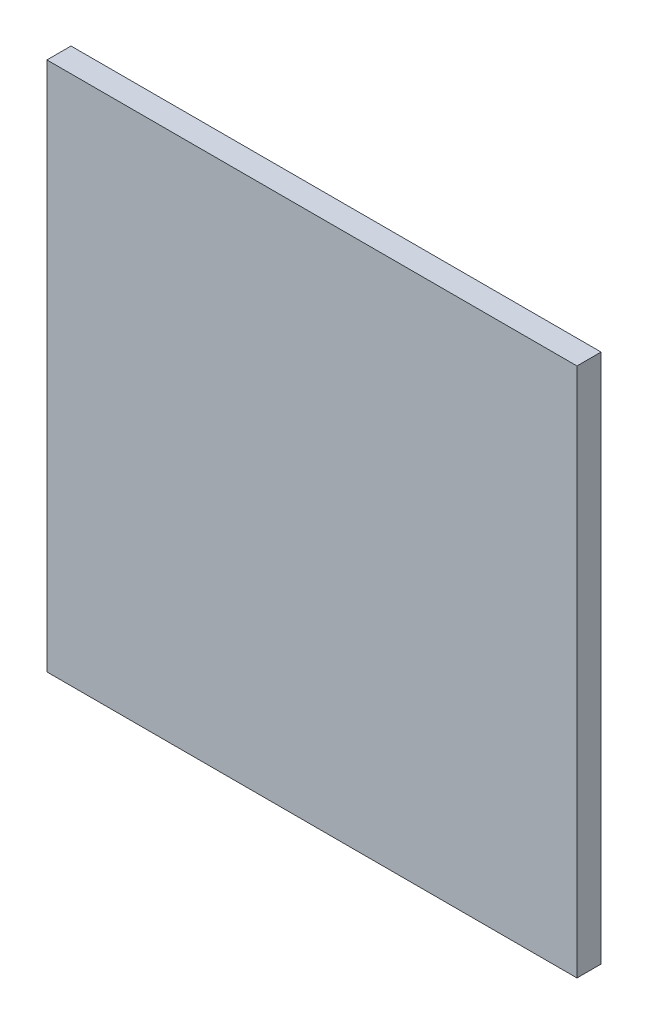
ISO-10303-21;
HEADER;
FILE_DESCRIPTION(('STEP AP214'),'2;1');
FILE_NAME('part.step','',(''),(''),'','','');
FILE_SCHEMA(('AUTOMOTIVE_DESIGN { 1 0 10303 214 1 1 1 1 }'));
ENDSEC;
DATA;
#1=APPLICATION_CONTEXT('core data for automotive mechanical design processes');
#2=APPLICATION_PROTOCOL_DEFINITION('international standard','automotive_design',2000,#1);
#3=PRODUCT_CONTEXT('',#1,'mechanical');
#4=PRODUCT('Part','Part','',(#3));
#5=PRODUCT_RELATED_PRODUCT_CATEGORY('part','',(#4));
#6=PRODUCT_DEFINITION_FORMATION('','',#4);
#7=PRODUCT_DEFINITION_CONTEXT('part definition',#1,'design');
#8=PRODUCT_DEFINITION('design','',#6,#7);
#9=PRODUCT_DEFINITION_SHAPE('','',#8);
#10=(LENGTH_UNIT() NAMED_UNIT(*) SI_UNIT(.MILLI.,.METRE.));
#11=(NAMED_UNIT(*) PLANE_ANGLE_UNIT() SI_UNIT($,.RADIAN.));
#12=(NAMED_UNIT(*) SI_UNIT($,.STERADIAN.) SOLID_ANGLE_UNIT());
#13=UNCERTAINTY_MEASURE_WITH_UNIT(LENGTH_MEASURE(1.E-05),#10,'distance_accuracy_value','');
#14=(GEOMETRIC_REPRESENTATION_CONTEXT(3) GLOBAL_UNCERTAINTY_ASSIGNED_CONTEXT((#13)) GLOBAL_UNIT_ASSIGNED_CONTEXT((#10,
#11,#12)) REPRESENTATION_CONTEXT('',''));
#15=CARTESIAN_POINT('',(0.,0.,0.));
#16=DIRECTION('',(0.,0.,1.));
#17=DIRECTION('',(1.,0.,0.));
#18=AXIS2_PLACEMENT_3D('',#15,#16,#17);
#19=CARTESIAN_POINT('',(0.,0.,12.7));
#20=DIRECTION('',(1.,0.,0.));
#21=DIRECTION('',(0.,0.,-1.));
#22=AXIS2_PLACEMENT_3D('',#19,#20,#21);
#23=PLANE('',#22);
#24=DIRECTION('',(0.,-1.,0.));
#25=VECTOR('',#24,1.);
#26=CARTESIAN_POINT('',(0.,0.,0.));
#27=LINE('',#26,#25);
#28=CARTESIAN_POINT('',(0.,279.4,0.));
#29=VERTEX_POINT('',#28);
#30=CARTESIAN_POINT('',(0.,0.,0.));
#31=VERTEX_POINT('',#30);
#32=EDGE_CURVE('E111',#29,#31,#27,.T.);
#33=ORIENTED_EDGE('',*,*,#32,.T.);
#34=DIRECTION('',(0.,0.,-1.));
#35=VECTOR('',#34,1.);
#36=CARTESIAN_POINT('',(0.,0.,12.7));
#37=LINE('',#36,#35);
#38=CARTESIAN_POINT('',(0.,0.,12.7));
#39=VERTEX_POINT('',#38);
#40=EDGE_CURVE('E11',#39,#31,#37,.T.);
#41=ORIENTED_EDGE('',*,*,#40,.F.);
#42=DIRECTION('',(0.,-1.,0.));
#43=VECTOR('',#42,1.);
#44=CARTESIAN_POINT('',(0.,0.,12.7));
#45=LINE('',#44,#43);
#46=CARTESIAN_POINT('',(0.,279.4,12.7));
#47=VERTEX_POINT('',#46);
#48=EDGE_CURVE('E95',#47,#39,#45,.T.);
#49=ORIENTED_EDGE('',*,*,#48,.F.);
#50=DIRECTION('',(0.,0.,-1.));
#51=VECTOR('',#50,1.);
#52=CARTESIAN_POINT('',(0.,279.4,12.7));
#53=LINE('',#52,#51);
#54=EDGE_CURVE('E107',#47,#29,#53,.T.);
#55=ORIENTED_EDGE('',*,*,#54,.T.);
#56=EDGE_LOOP('',(#33,#41,#49,#55));
#57=FACE_BOUND('',#56,.T.);
#58=ADVANCED_FACE('F43',(#57),#23,.F.);
#59=CARTESIAN_POINT('',(0.,0.,12.7));
#60=DIRECTION('',(0.,1.,0.));
#61=DIRECTION('',(0.,0.,1.));
#62=AXIS2_PLACEMENT_3D('',#59,#60,#61);
#63=PLANE('',#62);
#64=DIRECTION('',(1.,0.,0.));
#65=VECTOR('',#64,1.);
#66=CARTESIAN_POINT('',(0.,0.,0.));
#67=LINE('',#66,#65);
#68=CARTESIAN_POINT('',(279.4,0.,0.));
#69=VERTEX_POINT('',#68);
#70=EDGE_CURVE('E100',#31,#69,#67,.T.);
#71=ORIENTED_EDGE('',*,*,#70,.T.);
#72=DIRECTION('',(0.,0.,-1.));
#73=VECTOR('',#72,1.);
#74=CARTESIAN_POINT('',(279.4,0.,12.7));
#75=LINE('',#74,#73);
#76=CARTESIAN_POINT('',(279.4,0.,12.7));
#77=VERTEX_POINT('',#76);
#78=EDGE_CURVE('E52',#77,#69,#75,.T.);
#79=ORIENTED_EDGE('',*,*,#78,.F.);
#80=DIRECTION('',(1.,0.,0.));
#81=VECTOR('',#80,1.);
#82=CARTESIAN_POINT('',(0.,0.,12.7));
#83=LINE('',#82,#81);
#84=EDGE_CURVE('E90',#39,#77,#83,.T.);
#85=ORIENTED_EDGE('',*,*,#84,.F.);
#86=ORIENTED_EDGE('',*,*,#40,.T.);
#87=EDGE_LOOP('',(#71,#79,#85,#86));
#88=FACE_BOUND('',#87,.T.);
#89=ADVANCED_FACE('F99',(#88),#63,.F.);
#90=CARTESIAN_POINT('',(279.4,0.,12.7));
#91=DIRECTION('',(-1.,0.,0.));
#92=DIRECTION('',(0.,0.,1.));
#93=AXIS2_PLACEMENT_3D('',#90,#91,#92);
#94=PLANE('',#93);
#95=DIRECTION('',(0.,1.,0.));
#96=VECTOR('',#95,1.);
#97=CARTESIAN_POINT('',(279.4,0.,0.));
#98=LINE('',#97,#96);
#99=CARTESIAN_POINT('',(279.4,279.4,0.));
#100=VERTEX_POINT('',#99);
#101=EDGE_CURVE('E77',#69,#100,#98,.T.);
#102=ORIENTED_EDGE('',*,*,#101,.T.);
#103=DIRECTION('',(0.,0.,-1.));
#104=VECTOR('',#103,1.);
#105=CARTESIAN_POINT('',(279.4,279.4,12.7));
#106=LINE('',#105,#104);
#107=CARTESIAN_POINT('',(279.4,279.4,12.7));
#108=VERTEX_POINT('',#107);
#109=EDGE_CURVE('E102',#108,#100,#106,.T.);
#110=ORIENTED_EDGE('',*,*,#109,.F.);
#111=DIRECTION('',(0.,1.,0.));
#112=VECTOR('',#111,1.);
#113=CARTESIAN_POINT('',(279.4,0.,12.7));
#114=LINE('',#113,#112);
#115=EDGE_CURVE('E93',#77,#108,#114,.T.);
#116=ORIENTED_EDGE('',*,*,#115,.F.);
#117=ORIENTED_EDGE('',*,*,#78,.T.);
#118=EDGE_LOOP('',(#102,#110,#116,#117));
#119=FACE_BOUND('',#118,.T.);
#120=ADVANCED_FACE('F103',(#119),#94,.F.);
#121=CARTESIAN_POINT('',(0.,279.4,12.7));
#122=DIRECTION('',(0.,-1.,0.));
#123=DIRECTION('',(0.,0.,-1.));
#124=AXIS2_PLACEMENT_3D('',#121,#122,#123);
#125=PLANE('',#124);
#126=DIRECTION('',(-1.,0.,0.));
#127=VECTOR('',#126,1.);
#128=CARTESIAN_POINT('',(0.,279.4,0.));
#129=LINE('',#128,#127);
#130=EDGE_CURVE('E83',#100,#29,#129,.T.);
#131=ORIENTED_EDGE('',*,*,#130,.T.);
#132=ORIENTED_EDGE('',*,*,#54,.F.);
#133=DIRECTION('',(-1.,0.,0.));
#134=VECTOR('',#133,1.);
#135=CARTESIAN_POINT('',(0.,279.4,12.7));
#136=LINE('',#135,#134);
#137=EDGE_CURVE('E60',#108,#47,#136,.T.);
#138=ORIENTED_EDGE('',*,*,#137,.F.);
#139=ORIENTED_EDGE('',*,*,#109,.T.);
#140=EDGE_LOOP('',(#131,#132,#138,#139));
#141=FACE_BOUND('',#140,.T.);
#142=ADVANCED_FACE('F124',(#141),#125,.F.);
#143=CARTESIAN_POINT('',(0.,0.,12.7));
#144=DIRECTION('',(0.,0.,-1.));
#145=DIRECTION('',(-1.,0.,0.));
#146=AXIS2_PLACEMENT_3D('',#143,#144,#145);
#147=PLANE('',#146);
#148=ORIENTED_EDGE('',*,*,#48,.T.);
#149=ORIENTED_EDGE('',*,*,#84,.T.);
#150=ORIENTED_EDGE('',*,*,#115,.T.);
#151=ORIENTED_EDGE('',*,*,#137,.T.);
#152=EDGE_LOOP('',(#148,#149,#150,#151));
#153=FACE_BOUND('',#152,.T.);
#154=ADVANCED_FACE('F91',(#153),#147,.F.);
#155=CARTESIAN_POINT('',(0.,0.,0.));
#156=DIRECTION('',(0.,0.,-1.));
#157=DIRECTION('',(-1.,0.,0.));
#158=AXIS2_PLACEMENT_3D('',#155,#156,#157);
#159=PLANE('',#158);
#160=ORIENTED_EDGE('',*,*,#32,.F.);
#161=ORIENTED_EDGE('',*,*,#130,.F.);
#162=ORIENTED_EDGE('',*,*,#101,.F.);
#163=ORIENTED_EDGE('',*,*,#70,.F.);
#164=EDGE_LOOP('',(#160,#161,#162,#163));
#165=FACE_BOUND('',#164,.T.);
#166=ADVANCED_FACE('F127',(#165),#159,.T.);
#167=CLOSED_SHELL('',(#58,#89,#120,#142,#154,#166));
#168=MANIFOLD_SOLID_BREP('B2',#167);
#169=ADVANCED_BREP_SHAPE_REPRESENTATION('',(#18,#168),#14);
#170=SHAPE_DEFINITION_REPRESENTATION(#9,#169);
ENDSEC;
END-ISO-10303-21;
